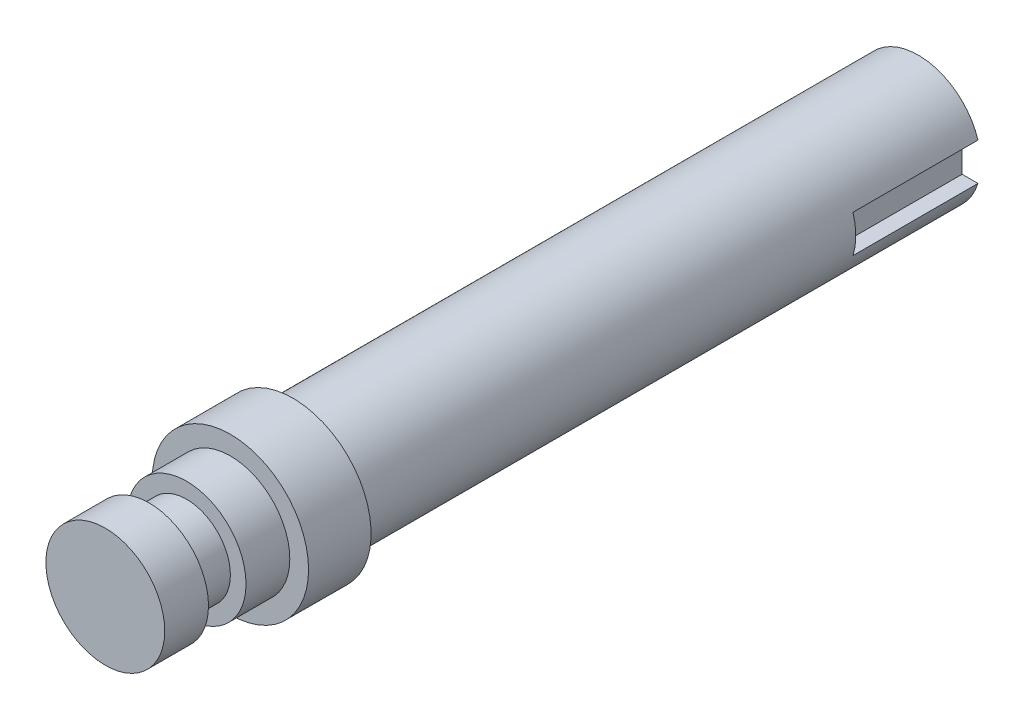
ISO-10303-21;
HEADER;
FILE_DESCRIPTION(('STEP AP214'),'2;1');
FILE_NAME('part.step','',(''),(''),'','','');
FILE_SCHEMA(('AUTOMOTIVE_DESIGN { 1 0 10303 214 1 1 1 1 }'));
ENDSEC;
DATA;
#1=APPLICATION_CONTEXT('core data for automotive mechanical design processes');
#2=APPLICATION_PROTOCOL_DEFINITION('international standard','automotive_design',2000,#1);
#3=PRODUCT_CONTEXT('',#1,'mechanical');
#4=PRODUCT('Part','Part','',(#3));
#5=PRODUCT_RELATED_PRODUCT_CATEGORY('part','',(#4));
#6=PRODUCT_DEFINITION_FORMATION('','',#4);
#7=PRODUCT_DEFINITION_CONTEXT('part definition',#1,'design');
#8=PRODUCT_DEFINITION('design','',#6,#7);
#9=PRODUCT_DEFINITION_SHAPE('','',#8);
#10=(LENGTH_UNIT() NAMED_UNIT(*) SI_UNIT(.MILLI.,.METRE.));
#11=(NAMED_UNIT(*) PLANE_ANGLE_UNIT() SI_UNIT($,.RADIAN.));
#12=(NAMED_UNIT(*) SI_UNIT($,.STERADIAN.) SOLID_ANGLE_UNIT());
#13=UNCERTAINTY_MEASURE_WITH_UNIT(LENGTH_MEASURE(1.E-05),#10,'distance_accuracy_value','');
#14=(GEOMETRIC_REPRESENTATION_CONTEXT(3) GLOBAL_UNCERTAINTY_ASSIGNED_CONTEXT((#13)) GLOBAL_UNIT_ASSIGNED_CONTEXT((#10,
#11,#12)) REPRESENTATION_CONTEXT('',''));
#15=CARTESIAN_POINT('',(0.,0.,0.));
#16=DIRECTION('',(0.,0.,1.));
#17=DIRECTION('',(1.,0.,0.));
#18=AXIS2_PLACEMENT_3D('',#15,#16,#17);
#19=CARTESIAN_POINT('',(0.,0.,65.));
#20=DIRECTION('',(0.,0.,-1.));
#21=DIRECTION('',(-1.,0.,0.));
#22=AXIS2_PLACEMENT_3D('',#19,#20,#21);
#23=CYLINDRICAL_SURFACE('',#22,12.5);
#24=CARTESIAN_POINT('',(0.,0.,35.));
#25=DIRECTION('',(0.,0.,-1.));
#26=DIRECTION('',(-1.,0.,0.));
#27=AXIS2_PLACEMENT_3D('',#24,#25,#26);
#28=CIRCLE('',#27,12.5);
#29=CARTESIAN_POINT('',(-12.5,0.,35.));
#30=VERTEX_POINT('',#29);
#31=EDGE_CURVE('E52',#30,#30,#28,.T.);
#32=ORIENTED_EDGE('',*,*,#31,.F.);
#33=EDGE_LOOP('',(#32));
#34=FACE_BOUND('',#33,.T.);
#35=CARTESIAN_POINT('',(0.,0.,45.));
#36=DIRECTION('',(0.,0.,1.));
#37=DIRECTION('',(1.,0.,0.));
#38=AXIS2_PLACEMENT_3D('',#35,#36,#37);
#39=CIRCLE('',#38,12.5);
#40=CARTESIAN_POINT('',(12.5,0.,45.));
#41=VERTEX_POINT('',#40);
#42=EDGE_CURVE('E138',#41,#41,#39,.T.);
#43=ORIENTED_EDGE('',*,*,#42,.F.);
#44=EDGE_LOOP('',(#43));
#45=FACE_BOUND('',#44,.T.);
#46=ADVANCED_FACE('F44',(#34,#45),#23,.T.);
#47=CARTESIAN_POINT('',(0.,0.,35.));
#48=DIRECTION('',(0.,0.,-1.));
#49=DIRECTION('',(-1.,0.,0.));
#50=AXIS2_PLACEMENT_3D('',#47,#48,#49);
#51=PLANE('',#50);
#52=CARTESIAN_POINT('',(0.,0.,35.));
#53=DIRECTION('',(0.,0.,-1.));
#54=DIRECTION('',(-1.,0.,0.));
#55=AXIS2_PLACEMENT_3D('',#52,#53,#54);
#56=CIRCLE('',#55,10.);
#57=CARTESIAN_POINT('',(-10.,0.,35.));
#58=VERTEX_POINT('',#57);
#59=EDGE_CURVE('E123',#58,#58,#56,.T.);
#60=ORIENTED_EDGE('',*,*,#59,.F.);
#61=EDGE_LOOP('',(#60));
#62=FACE_BOUND('',#61,.T.);
#63=ORIENTED_EDGE('',*,*,#31,.T.);
#64=EDGE_LOOP('',(#63));
#65=FACE_BOUND('',#64,.T.);
#66=ADVANCED_FACE('F132',(#62,#65),#51,.T.);
#67=CARTESIAN_POINT('',(0.,0.,35.));
#68=DIRECTION('',(0.,0.,-1.));
#69=DIRECTION('',(-1.,0.,0.));
#70=AXIS2_PLACEMENT_3D('',#67,#68,#69);
#71=CYLINDRICAL_SURFACE('',#70,10.);
#72=DIRECTION('',(0.,0.,-1.));
#73=VECTOR('',#72,1.);
#74=CARTESIAN_POINT('',(9.53939201416946,-3.,35.));
#75=LINE('',#74,#73);
#76=CARTESIAN_POINT('',(9.53939201416946,-3.,-45.));
#77=VERTEX_POINT('',#76);
#78=CARTESIAN_POINT('',(9.53939201416946,-3.,-65.));
#79=VERTEX_POINT('',#78);
#80=EDGE_CURVE('E66',#77,#79,#75,.T.);
#81=ORIENTED_EDGE('',*,*,#80,.F.);
#82=CARTESIAN_POINT('',(0.,0.,-45.));
#83=DIRECTION('',(0.,0.,1.));
#84=DIRECTION('',(1.,0.,0.));
#85=AXIS2_PLACEMENT_3D('',#82,#83,#84);
#86=CIRCLE('',#85,10.);
#87=CARTESIAN_POINT('',(9.53939201416946,3.,-45.));
#88=VERTEX_POINT('',#87);
#89=EDGE_CURVE('E12',#88,#77,#86,.F.);
#90=ORIENTED_EDGE('',*,*,#89,.F.);
#91=DIRECTION('',(0.,0.,-1.));
#92=VECTOR('',#91,1.);
#93=CARTESIAN_POINT('',(9.53939201416946,2.99999999999999,35.));
#94=LINE('',#93,#92);
#95=CARTESIAN_POINT('',(9.53939201416946,3.,-65.));
#96=VERTEX_POINT('',#95);
#97=EDGE_CURVE('E117',#96,#88,#94,.F.);
#98=ORIENTED_EDGE('',*,*,#97,.F.);
#99=CARTESIAN_POINT('',(0.,0.,-65.));
#100=DIRECTION('',(0.,0.,-1.));
#101=DIRECTION('',(-1.,0.,0.));
#102=AXIS2_PLACEMENT_3D('',#99,#100,#101);
#103=CIRCLE('',#102,10.);
#104=EDGE_CURVE('E107',#79,#96,#103,.T.);
#105=ORIENTED_EDGE('',*,*,#104,.F.);
#106=EDGE_LOOP('',(#81,#90,#98,#105));
#107=FACE_BOUND('',#106,.T.);
#108=ORIENTED_EDGE('',*,*,#59,.T.);
#109=EDGE_LOOP('',(#108));
#110=FACE_BOUND('',#109,.T.);
#111=ADVANCED_FACE('F172',(#107,#110),#71,.T.);
#112=CARTESIAN_POINT('',(0.,0.,-65.));
#113=DIRECTION('',(0.,0.,1.));
#114=DIRECTION('',(1.,0.,0.));
#115=AXIS2_PLACEMENT_3D('',#112,#113,#114);
#116=PLANE('',#115);
#117=DIRECTION('',(0.,1.,0.));
#118=VECTOR('',#117,1.);
#119=CARTESIAN_POINT('',(7.,3.,-65.));
#120=LINE('',#119,#118);
#121=CARTESIAN_POINT('',(7.,-3.,-65.));
#122=VERTEX_POINT('',#121);
#123=CARTESIAN_POINT('',(7.,3.,-65.));
#124=VERTEX_POINT('',#123);
#125=EDGE_CURVE('E96',#122,#124,#120,.T.);
#126=ORIENTED_EDGE('',*,*,#125,.F.);
#127=DIRECTION('',(1.,0.,0.));
#128=VECTOR('',#127,1.);
#129=CARTESIAN_POINT('',(7.,-3.,-65.));
#130=LINE('',#129,#128);
#131=EDGE_CURVE('E120',#122,#79,#130,.T.);
#132=ORIENTED_EDGE('',*,*,#131,.T.);
#133=ORIENTED_EDGE('',*,*,#104,.T.);
#134=DIRECTION('',(1.,0.,0.));
#135=VECTOR('',#134,1.);
#136=CARTESIAN_POINT('',(7.,3.,-65.));
#137=LINE('',#136,#135);
#138=EDGE_CURVE('E89',#124,#96,#137,.T.);
#139=ORIENTED_EDGE('',*,*,#138,.F.);
#140=EDGE_LOOP('',(#126,#132,#133,#139));
#141=FACE_BOUND('',#140,.T.);
#142=ADVANCED_FACE('F105',(#141),#116,.F.);
#143=CARTESIAN_POINT('',(7.,-3.,-45.));
#144=DIRECTION('',(0.,-1.,0.));
#145=DIRECTION('',(0.,0.,-1.));
#146=AXIS2_PLACEMENT_3D('',#143,#144,#145);
#147=PLANE('',#146);
#148=ORIENTED_EDGE('',*,*,#80,.T.);
#149=ORIENTED_EDGE('',*,*,#131,.F.);
#150=DIRECTION('',(0.,0.,-1.));
#151=VECTOR('',#150,1.);
#152=CARTESIAN_POINT('',(7.,-3.,-45.));
#153=LINE('',#152,#151);
#154=CARTESIAN_POINT('',(7.,-3.,-45.));
#155=VERTEX_POINT('',#154);
#156=EDGE_CURVE('E59',#155,#122,#153,.T.);
#157=ORIENTED_EDGE('',*,*,#156,.F.);
#158=DIRECTION('',(1.,0.,0.));
#159=VECTOR('',#158,1.);
#160=CARTESIAN_POINT('',(7.,-3.,-45.));
#161=LINE('',#160,#159);
#162=EDGE_CURVE('E112',#155,#77,#161,.T.);
#163=ORIENTED_EDGE('',*,*,#162,.T.);
#164=EDGE_LOOP('',(#148,#149,#157,#163));
#165=FACE_BOUND('',#164,.T.);
#166=ADVANCED_FACE('F168',(#165),#147,.F.);
#167=CARTESIAN_POINT('',(7.,3.,-45.));
#168=DIRECTION('',(0.,0.,1.));
#169=DIRECTION('',(1.,0.,0.));
#170=AXIS2_PLACEMENT_3D('',#167,#168,#169);
#171=PLANE('',#170);
#172=ORIENTED_EDGE('',*,*,#89,.T.);
#173=ORIENTED_EDGE('',*,*,#162,.F.);
#174=DIRECTION('',(0.,-1.,0.));
#175=VECTOR('',#174,1.);
#176=CARTESIAN_POINT('',(7.,3.,-45.));
#177=LINE('',#176,#175);
#178=CARTESIAN_POINT('',(7.,3.,-45.));
#179=VERTEX_POINT('',#178);
#180=EDGE_CURVE('E95',#179,#155,#177,.T.);
#181=ORIENTED_EDGE('',*,*,#180,.F.);
#182=DIRECTION('',(1.,0.,0.));
#183=VECTOR('',#182,1.);
#184=CARTESIAN_POINT('',(7.,3.,-45.));
#185=LINE('',#184,#183);
#186=EDGE_CURVE('E92',#179,#88,#185,.T.);
#187=ORIENTED_EDGE('',*,*,#186,.T.);
#188=EDGE_LOOP('',(#172,#173,#181,#187));
#189=FACE_BOUND('',#188,.T.);
#190=ADVANCED_FACE('F174',(#189),#171,.F.);
#191=CARTESIAN_POINT('',(7.,3.,-65.));
#192=DIRECTION('',(0.,1.,0.));
#193=DIRECTION('',(0.,0.,1.));
#194=AXIS2_PLACEMENT_3D('',#191,#192,#193);
#195=PLANE('',#194);
#196=ORIENTED_EDGE('',*,*,#97,.T.);
#197=ORIENTED_EDGE('',*,*,#186,.F.);
#198=DIRECTION('',(0.,0.,1.));
#199=VECTOR('',#198,1.);
#200=CARTESIAN_POINT('',(7.,3.,-65.));
#201=LINE('',#200,#199);
#202=EDGE_CURVE('E86',#124,#179,#201,.T.);
#203=ORIENTED_EDGE('',*,*,#202,.F.);
#204=ORIENTED_EDGE('',*,*,#138,.T.);
#205=EDGE_LOOP('',(#196,#197,#203,#204));
#206=FACE_BOUND('',#205,.T.);
#207=ADVANCED_FACE('F87',(#206),#195,.F.);
#208=CARTESIAN_POINT('',(7.,0.,0.));
#209=DIRECTION('',(1.,0.,0.));
#210=DIRECTION('',(0.,0.,-1.));
#211=AXIS2_PLACEMENT_3D('',#208,#209,#210);
#212=PLANE('',#211);
#213=ORIENTED_EDGE('',*,*,#125,.T.);
#214=ORIENTED_EDGE('',*,*,#202,.T.);
#215=ORIENTED_EDGE('',*,*,#180,.T.);
#216=ORIENTED_EDGE('',*,*,#156,.T.);
#217=EDGE_LOOP('',(#213,#214,#215,#216));
#218=FACE_BOUND('',#217,.T.);
#219=ADVANCED_FACE('F99',(#218),#212,.T.);
#220=CARTESIAN_POINT('',(0.,0.,45.));
#221=DIRECTION('',(0.,0.,1.));
#222=DIRECTION('',(1.,0.,0.));
#223=AXIS2_PLACEMENT_3D('',#220,#221,#222);
#224=PLANE('',#223);
#225=CARTESIAN_POINT('',(0.,0.,45.));
#226=DIRECTION('',(0.,0.,1.));
#227=DIRECTION('',(1.,0.,0.));
#228=AXIS2_PLACEMENT_3D('',#225,#226,#227);
#229=CIRCLE('',#228,9.5);
#230=CARTESIAN_POINT('',(9.5,0.,45.));
#231=VERTEX_POINT('',#230);
#232=EDGE_CURVE('E142',#231,#231,#229,.T.);
#233=ORIENTED_EDGE('',*,*,#232,.F.);
#234=EDGE_LOOP('',(#233));
#235=FACE_BOUND('',#234,.T.);
#236=ORIENTED_EDGE('',*,*,#42,.T.);
#237=EDGE_LOOP('',(#236));
#238=FACE_BOUND('',#237,.T.);
#239=ADVANCED_FACE('F227',(#235,#238),#224,.T.);
#240=CARTESIAN_POINT('',(0.,0.,45.));
#241=DIRECTION('',(0.,0.,1.));
#242=DIRECTION('',(1.,0.,0.));
#243=AXIS2_PLACEMENT_3D('',#240,#241,#242);
#244=CYLINDRICAL_SURFACE('',#243,9.5);
#245=ORIENTED_EDGE('',*,*,#232,.T.);
#246=EDGE_LOOP('',(#245));
#247=FACE_BOUND('',#246,.T.);
#248=CARTESIAN_POINT('',(0.,0.,52.));
#249=DIRECTION('',(0.,0.,1.));
#250=DIRECTION('',(1.,0.,0.));
#251=AXIS2_PLACEMENT_3D('',#248,#249,#250);
#252=CIRCLE('',#251,9.5);
#253=CARTESIAN_POINT('',(9.5,0.,52.));
#254=VERTEX_POINT('',#253);
#255=EDGE_CURVE('E150',#254,#254,#252,.T.);
#256=ORIENTED_EDGE('',*,*,#255,.F.);
#257=EDGE_LOOP('',(#256));
#258=FACE_BOUND('',#257,.T.);
#259=ADVANCED_FACE('F193',(#247,#258),#244,.T.);
#260=CARTESIAN_POINT('',(0.,0.,65.));
#261=DIRECTION('',(0.,0.,1.));
#262=DIRECTION('',(1.,0.,0.));
#263=AXIS2_PLACEMENT_3D('',#260,#261,#262);
#264=PLANE('',#263);
#265=CARTESIAN_POINT('',(0.,0.,65.));
#266=DIRECTION('',(0.,0.,1.));
#267=DIRECTION('',(1.,0.,0.));
#268=AXIS2_PLACEMENT_3D('',#265,#266,#267);
#269=CIRCLE('',#268,9.5);
#270=CARTESIAN_POINT('',(9.5,0.,65.));
#271=VERTEX_POINT('',#270);
#272=EDGE_CURVE('E102',#271,#271,#269,.T.);
#273=ORIENTED_EDGE('',*,*,#272,.T.);
#274=EDGE_LOOP('',(#273));
#275=FACE_BOUND('',#274,.T.);
#276=ADVANCED_FACE('F190',(#275),#264,.T.);
#277=CARTESIAN_POINT('',(0.,0.,58.));
#278=DIRECTION('',(0.,0.,1.));
#279=DIRECTION('',(1.,0.,0.));
#280=AXIS2_PLACEMENT_3D('',#277,#278,#279);
#281=CYLINDRICAL_SURFACE('',#280,9.5);
#282=CARTESIAN_POINT('',(0.,0.,58.));
#283=DIRECTION('',(0.,0.,1.));
#284=DIRECTION('',(1.,0.,0.));
#285=AXIS2_PLACEMENT_3D('',#282,#283,#284);
#286=CIRCLE('',#285,9.5);
#287=CARTESIAN_POINT('',(9.5,0.,58.));
#288=VERTEX_POINT('',#287);
#289=EDGE_CURVE('E156',#288,#288,#286,.F.);
#290=ORIENTED_EDGE('',*,*,#289,.F.);
#291=EDGE_LOOP('',(#290));
#292=FACE_BOUND('',#291,.T.);
#293=ORIENTED_EDGE('',*,*,#272,.F.);
#294=EDGE_LOOP('',(#293));
#295=FACE_BOUND('',#294,.T.);
#296=ADVANCED_FACE('F192',(#292,#295),#281,.T.);
#297=CARTESIAN_POINT('',(0.,0.,58.));
#298=DIRECTION('',(0.,0.,1.));
#299=DIRECTION('',(1.,0.,0.));
#300=AXIS2_PLACEMENT_3D('',#297,#298,#299);
#301=PLANE('',#300);
#302=ORIENTED_EDGE('',*,*,#289,.T.);
#303=EDGE_LOOP('',(#302));
#304=FACE_BOUND('',#303,.T.);
#305=CARTESIAN_POINT('',(0.,0.,58.));
#306=DIRECTION('',(0.,0.,1.));
#307=DIRECTION('',(1.,0.,0.));
#308=AXIS2_PLACEMENT_3D('',#305,#306,#307);
#309=CIRCLE('',#308,7.);
#310=CARTESIAN_POINT('',(7.,0.,58.));
#311=VERTEX_POINT('',#310);
#312=EDGE_CURVE('E141',#311,#311,#309,.T.);
#313=ORIENTED_EDGE('',*,*,#312,.T.);
#314=EDGE_LOOP('',(#313));
#315=FACE_BOUND('',#314,.T.);
#316=ADVANCED_FACE('F238',(#304,#315),#301,.F.);
#317=CARTESIAN_POINT('',(0.,0.,52.));
#318=DIRECTION('',(0.,0.,1.));
#319=DIRECTION('',(1.,0.,0.));
#320=AXIS2_PLACEMENT_3D('',#317,#318,#319);
#321=CYLINDRICAL_SURFACE('',#320,7.);
#322=CARTESIAN_POINT('',(0.,0.,52.));
#323=DIRECTION('',(0.,0.,1.));
#324=DIRECTION('',(1.,0.,0.));
#325=AXIS2_PLACEMENT_3D('',#322,#323,#324);
#326=CIRCLE('',#325,7.);
#327=CARTESIAN_POINT('',(7.,0.,52.));
#328=VERTEX_POINT('',#327);
#329=EDGE_CURVE('E147',#328,#328,#326,.T.);
#330=ORIENTED_EDGE('',*,*,#329,.T.);
#331=EDGE_LOOP('',(#330));
#332=FACE_BOUND('',#331,.T.);
#333=ORIENTED_EDGE('',*,*,#312,.F.);
#334=EDGE_LOOP('',(#333));
#335=FACE_BOUND('',#334,.T.);
#336=ADVANCED_FACE('F255',(#332,#335),#321,.T.);
#337=CARTESIAN_POINT('',(0.,0.,52.));
#338=DIRECTION('',(0.,0.,1.));
#339=DIRECTION('',(1.,0.,0.));
#340=AXIS2_PLACEMENT_3D('',#337,#338,#339);
#341=PLANE('',#340);
#342=ORIENTED_EDGE('',*,*,#329,.F.);
#343=EDGE_LOOP('',(#342));
#344=FACE_BOUND('',#343,.T.);
#345=ORIENTED_EDGE('',*,*,#255,.T.);
#346=EDGE_LOOP('',(#345));
#347=FACE_BOUND('',#346,.T.);
#348=ADVANCED_FACE('F266',(#344,#347),#341,.T.);
#349=CLOSED_SHELL('',(#46,#66,#111,#142,#166,#190,#207,#219,#239,#259,#276,#296,#316,#336,#348));
#350=MANIFOLD_SOLID_BREP('B2',#349);
#351=ADVANCED_BREP_SHAPE_REPRESENTATION('',(#18,#350),#14);
#352=SHAPE_DEFINITION_REPRESENTATION(#9,#351);
ENDSEC;
END-ISO-10303-21;
